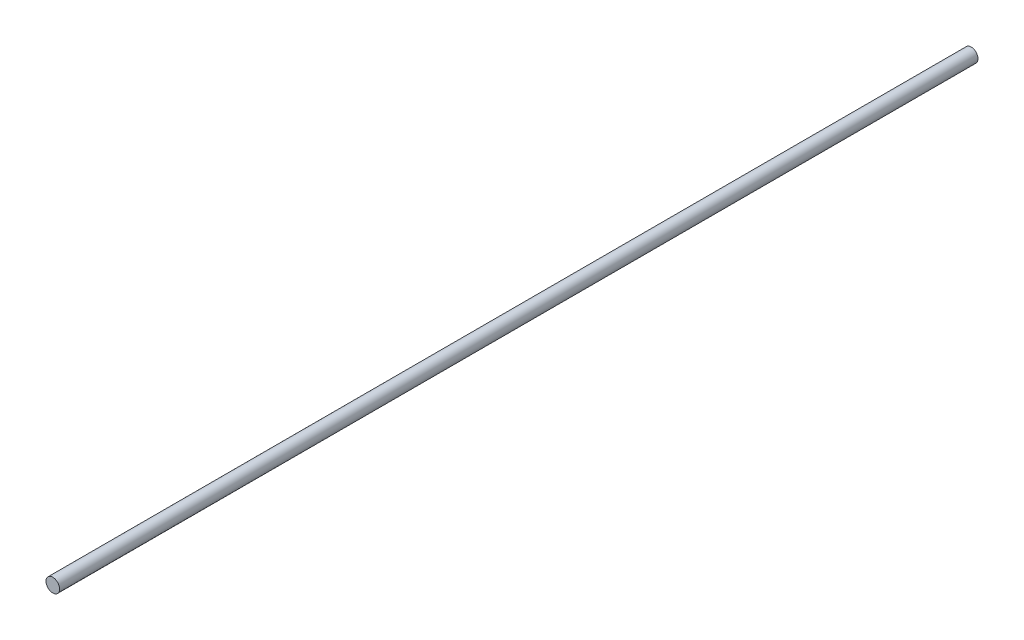
ISO-10303-21;
HEADER;
FILE_DESCRIPTION(('STEP AP214'),'2;1');
FILE_NAME('part.step','',(''),(''),'','','');
FILE_SCHEMA(('AUTOMOTIVE_DESIGN { 1 0 10303 214 1 1 1 1 }'));
ENDSEC;
DATA;
#1=APPLICATION_CONTEXT('core data for automotive mechanical design processes');
#2=APPLICATION_PROTOCOL_DEFINITION('international standard','automotive_design',2000,#1);
#3=PRODUCT_CONTEXT('',#1,'mechanical');
#4=PRODUCT('Part','Part','',(#3));
#5=PRODUCT_RELATED_PRODUCT_CATEGORY('part','',(#4));
#6=PRODUCT_DEFINITION_FORMATION('','',#4);
#7=PRODUCT_DEFINITION_CONTEXT('part definition',#1,'design');
#8=PRODUCT_DEFINITION('design','',#6,#7);
#9=PRODUCT_DEFINITION_SHAPE('','',#8);
#10=(LENGTH_UNIT() NAMED_UNIT(*) SI_UNIT(.MILLI.,.METRE.));
#11=(NAMED_UNIT(*) PLANE_ANGLE_UNIT() SI_UNIT($,.RADIAN.));
#12=(NAMED_UNIT(*) SI_UNIT($,.STERADIAN.) SOLID_ANGLE_UNIT());
#13=UNCERTAINTY_MEASURE_WITH_UNIT(LENGTH_MEASURE(1.E-05),#10,'distance_accuracy_value','');
#14=(GEOMETRIC_REPRESENTATION_CONTEXT(3) GLOBAL_UNCERTAINTY_ASSIGNED_CONTEXT((#13)) GLOBAL_UNIT_ASSIGNED_CONTEXT((#10,
#11,#12)) REPRESENTATION_CONTEXT('',''));
#15=CARTESIAN_POINT('',(0.,0.,0.));
#16=DIRECTION('',(0.,0.,1.));
#17=DIRECTION('',(1.,0.,0.));
#18=AXIS2_PLACEMENT_3D('',#15,#16,#17);
#19=CARTESIAN_POINT('',(0.,0.,540.));
#20=DIRECTION('',(0.,0.,-1.));
#21=DIRECTION('',(-1.,0.,0.));
#22=AXIS2_PLACEMENT_3D('',#19,#20,#21);
#23=CYLINDRICAL_SURFACE('',#22,4.);
#24=CARTESIAN_POINT('',(0.,0.,540.));
#25=DIRECTION('',(0.,0.,1.));
#26=DIRECTION('',(1.,0.,0.));
#27=AXIS2_PLACEMENT_3D('',#24,#25,#26);
#28=CIRCLE('',#27,4.);
#29=CARTESIAN_POINT('',(4.,0.,540.));
#30=VERTEX_POINT('',#29);
#31=EDGE_CURVE('E10',#30,#30,#28,.T.);
#32=ORIENTED_EDGE('',*,*,#31,.F.);
#33=EDGE_LOOP('',(#32));
#34=FACE_BOUND('',#33,.T.);
#35=CARTESIAN_POINT('',(0.,0.,0.));
#36=DIRECTION('',(0.,0.,1.));
#37=DIRECTION('',(1.,0.,0.));
#38=AXIS2_PLACEMENT_3D('',#35,#36,#37);
#39=CIRCLE('',#38,4.);
#40=CARTESIAN_POINT('',(4.,0.,0.));
#41=VERTEX_POINT('',#40);
#42=EDGE_CURVE('E33',#41,#41,#39,.T.);
#43=ORIENTED_EDGE('',*,*,#42,.T.);
#44=EDGE_LOOP('',(#43));
#45=FACE_BOUND('',#44,.T.);
#46=ADVANCED_FACE('F30',(#34,#45),#23,.T.);
#47=CARTESIAN_POINT('',(0.,0.,540.));
#48=DIRECTION('',(0.,0.,1.));
#49=DIRECTION('',(1.,0.,0.));
#50=AXIS2_PLACEMENT_3D('',#47,#48,#49);
#51=PLANE('',#50);
#52=ORIENTED_EDGE('',*,*,#31,.T.);
#53=EDGE_LOOP('',(#52));
#54=FACE_BOUND('',#53,.T.);
#55=ADVANCED_FACE('F45',(#54),#51,.T.);
#56=CARTESIAN_POINT('',(0.,0.,0.));
#57=DIRECTION('',(0.,0.,1.));
#58=DIRECTION('',(1.,0.,0.));
#59=AXIS2_PLACEMENT_3D('',#56,#57,#58);
#60=PLANE('',#59);
#61=ORIENTED_EDGE('',*,*,#42,.F.);
#62=EDGE_LOOP('',(#61));
#63=FACE_BOUND('',#62,.T.);
#64=ADVANCED_FACE('F43',(#63),#60,.F.);
#65=CLOSED_SHELL('',(#46,#55,#64));
#66=MANIFOLD_SOLID_BREP('B2',#65);
#67=ADVANCED_BREP_SHAPE_REPRESENTATION('',(#18,#66),#14);
#68=SHAPE_DEFINITION_REPRESENTATION(#9,#67);
ENDSEC;
END-ISO-10303-21;
